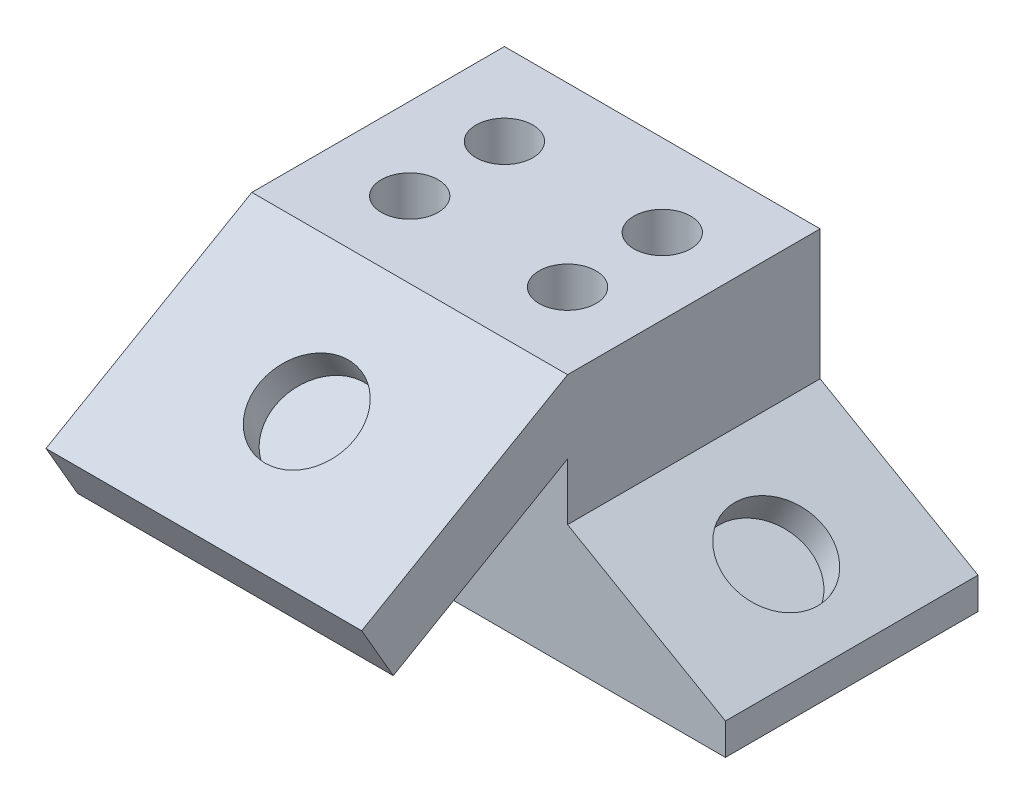
ISO-10303-21;
HEADER;
FILE_DESCRIPTION(('STEP AP214'),'2;1');
FILE_NAME('part.step','',(''),(''),'','','');
FILE_SCHEMA(('AUTOMOTIVE_DESIGN { 1 0 10303 214 1 1 1 1 }'));
ENDSEC;
DATA;
#1=APPLICATION_CONTEXT('core data for automotive mechanical design processes');
#2=APPLICATION_PROTOCOL_DEFINITION('international standard','automotive_design',2000,#1);
#3=PRODUCT_CONTEXT('',#1,'mechanical');
#4=PRODUCT('Part','Part','',(#3));
#5=PRODUCT_RELATED_PRODUCT_CATEGORY('part','',(#4));
#6=PRODUCT_DEFINITION_FORMATION('','',#4);
#7=PRODUCT_DEFINITION_CONTEXT('part definition',#1,'design');
#8=PRODUCT_DEFINITION('design','',#6,#7);
#9=PRODUCT_DEFINITION_SHAPE('','',#8);
#10=(LENGTH_UNIT() NAMED_UNIT(*) SI_UNIT(.MILLI.,.METRE.));
#11=(NAMED_UNIT(*) PLANE_ANGLE_UNIT() SI_UNIT($,.RADIAN.));
#12=(NAMED_UNIT(*) SI_UNIT($,.STERADIAN.) SOLID_ANGLE_UNIT());
#13=UNCERTAINTY_MEASURE_WITH_UNIT(LENGTH_MEASURE(1.E-05),#10,'distance_accuracy_value','');
#14=(GEOMETRIC_REPRESENTATION_CONTEXT(3) GLOBAL_UNCERTAINTY_ASSIGNED_CONTEXT((#13)) GLOBAL_UNIT_ASSIGNED_CONTEXT((#10,
#11,#12)) REPRESENTATION_CONTEXT('',''));
#15=CARTESIAN_POINT('',(0.,0.,0.));
#16=DIRECTION('',(0.,0.,1.));
#17=DIRECTION('',(1.,0.,0.));
#18=AXIS2_PLACEMENT_3D('',#15,#16,#17);
#19=CARTESIAN_POINT('',(0.,50.8,0.));
#20=DIRECTION('',(0.,1.,0.));
#21=DIRECTION('',(0.,0.,1.));
#22=AXIS2_PLACEMENT_3D('',#19,#20,#21);
#23=PLANE('',#22);
#24=CARTESIAN_POINT('',(16.51,50.8,10.16));
#25=DIRECTION('',(0.,-1.,0.));
#26=DIRECTION('',(0.,0.,-1.));
#27=AXIS2_PLACEMENT_3D('',#24,#25,#26);
#28=CIRCLE('',#27,5.715);
#29=CARTESIAN_POINT('',(16.51,50.8,4.44499999999999));
#30=VERTEX_POINT('',#29);
#31=EDGE_CURVE('E452',#30,#30,#28,.T.);
#32=ORIENTED_EDGE('',*,*,#31,.T.);
#33=EDGE_LOOP('',(#32));
#34=FACE_BOUND('',#33,.T.);
#35=CARTESIAN_POINT('',(-15.24,50.8,-8.89000000000001));
#36=DIRECTION('',(0.,-1.,0.));
#37=DIRECTION('',(0.,0.,-1.));
#38=AXIS2_PLACEMENT_3D('',#35,#36,#37);
#39=CIRCLE('',#38,5.715);
#40=CARTESIAN_POINT('',(-15.24,50.8,-14.605));
#41=VERTEX_POINT('',#40);
#42=EDGE_CURVE('E437',#41,#41,#39,.T.);
#43=ORIENTED_EDGE('',*,*,#42,.T.);
#44=EDGE_LOOP('',(#43));
#45=FACE_BOUND('',#44,.T.);
#46=DIRECTION('',(0.,0.,1.));
#47=VECTOR('',#46,1.);
#48=CARTESIAN_POINT('',(-31.75,50.8,25.4));
#49=LINE('',#48,#47);
#50=CARTESIAN_POINT('',(-31.75,50.8,-25.4));
#51=VERTEX_POINT('',#50);
#52=CARTESIAN_POINT('',(-31.75,50.8,25.4));
#53=VERTEX_POINT('',#52);
#54=EDGE_CURVE('E172',#51,#53,#49,.T.);
#55=ORIENTED_EDGE('',*,*,#54,.T.);
#56=DIRECTION('',(1.,0.,0.));
#57=VECTOR('',#56,1.);
#58=CARTESIAN_POINT('',(31.75,50.8,25.4));
#59=LINE('',#58,#57);
#60=CARTESIAN_POINT('',(31.75,50.8,25.4));
#61=VERTEX_POINT('',#60);
#62=EDGE_CURVE('E132',#53,#61,#59,.T.);
#63=ORIENTED_EDGE('',*,*,#62,.T.);
#64=DIRECTION('',(0.,0.,-1.));
#65=VECTOR('',#64,1.);
#66=CARTESIAN_POINT('',(31.75,50.8,25.4));
#67=LINE('',#66,#65);
#68=CARTESIAN_POINT('',(31.75,50.8,-25.4));
#69=VERTEX_POINT('',#68);
#70=EDGE_CURVE('E176',#61,#69,#67,.T.);
#71=ORIENTED_EDGE('',*,*,#70,.T.);
#72=DIRECTION('',(-1.,0.,0.));
#73=VECTOR('',#72,1.);
#74=CARTESIAN_POINT('',(31.75,50.8,-25.4));
#75=LINE('',#74,#73);
#76=EDGE_CURVE('E178',#69,#51,#75,.T.);
#77=ORIENTED_EDGE('',*,*,#76,.T.);
#78=EDGE_LOOP('',(#55,#63,#71,#77));
#79=FACE_BOUND('',#78,.T.);
#80=CARTESIAN_POINT('',(16.51,50.8,-8.89000000000001));
#81=DIRECTION('',(0.,1.,0.));
#82=DIRECTION('',(0.,0.,1.));
#83=AXIS2_PLACEMENT_3D('',#80,#81,#82);
#84=CIRCLE('',#83,5.715);
#85=CARTESIAN_POINT('',(16.51,50.8,-3.17500000000001));
#86=VERTEX_POINT('',#85);
#87=EDGE_CURVE('E439',#86,#86,#84,.T.);
#88=ORIENTED_EDGE('',*,*,#87,.F.);
#89=EDGE_LOOP('',(#88));
#90=FACE_BOUND('',#89,.T.);
#91=CARTESIAN_POINT('',(-15.24,50.8,10.16));
#92=DIRECTION('',(0.,1.,0.));
#93=DIRECTION('',(0.,0.,1.));
#94=AXIS2_PLACEMENT_3D('',#91,#92,#93);
#95=CIRCLE('',#94,5.715);
#96=CARTESIAN_POINT('',(-15.24,50.8,15.875));
#97=VERTEX_POINT('',#96);
#98=EDGE_CURVE('E427',#97,#97,#95,.T.);
#99=ORIENTED_EDGE('',*,*,#98,.F.);
#100=EDGE_LOOP('',(#99));
#101=FACE_BOUND('',#100,.T.);
#102=ADVANCED_FACE('F38',(#34,#45,#79,#90,#101),#23,.T.);
#103=CARTESIAN_POINT('',(31.75,50.8,25.4));
#104=DIRECTION('',(0.,0.,-1.));
#105=DIRECTION('',(-1.,0.,0.));
#106=AXIS2_PLACEMENT_3D('',#103,#104,#105);
#107=PLANE('',#106);
#108=DIRECTION('',(1.,0.,0.));
#109=VECTOR('',#108,1.);
#110=CARTESIAN_POINT('',(-31.75,36.1353031625836,25.4));
#111=LINE('',#110,#109);
#112=CARTESIAN_POINT('',(-31.75,36.1353031625836,25.4));
#113=VERTEX_POINT('',#112);
#114=CARTESIAN_POINT('',(31.75,36.1353031625836,25.4));
#115=VERTEX_POINT('',#114);
#116=EDGE_CURVE('E52',#113,#115,#111,.T.);
#117=ORIENTED_EDGE('',*,*,#116,.F.);
#118=DIRECTION('',(0.,-1.,0.));
#119=VECTOR('',#118,1.);
#120=CARTESIAN_POINT('',(-31.75,50.8,25.4));
#121=LINE('',#120,#119);
#122=CARTESIAN_POINT('',(-31.75,0.,25.4));
#123=VERTEX_POINT('',#122);
#124=EDGE_CURVE('E11',#113,#123,#121,.T.);
#125=ORIENTED_EDGE('',*,*,#124,.T.);
#126=DIRECTION('',(1.,0.,0.));
#127=VECTOR('',#126,1.);
#128=CARTESIAN_POINT('',(31.75,0.,25.4));
#129=LINE('',#128,#127);
#130=CARTESIAN_POINT('',(63.5,0.,25.4));
#131=VERTEX_POINT('',#130);
#132=EDGE_CURVE('E182',#123,#131,#129,.T.);
#133=ORIENTED_EDGE('',*,*,#132,.T.);
#134=DIRECTION('',(0.,-1.,0.));
#135=VECTOR('',#134,1.);
#136=CARTESIAN_POINT('',(63.5,0.,25.4));
#137=LINE('',#136,#135);
#138=CARTESIAN_POINT('',(63.5,6.35,25.4));
#139=VERTEX_POINT('',#138);
#140=EDGE_CURVE('E152',#139,#131,#137,.T.);
#141=ORIENTED_EDGE('',*,*,#140,.F.);
#142=DIRECTION('',(0.86602540378444,-0.499999999999998,0.));
#143=VECTOR('',#142,1.);
#144=CARTESIAN_POINT('',(18.6246306570154,32.2588065701559,25.4));
#145=LINE('',#144,#143);
#146=CARTESIAN_POINT('',(31.75,24.6808710467705,25.4));
#147=VERTEX_POINT('',#146);
#148=EDGE_CURVE('E159',#147,#139,#145,.T.);
#149=ORIENTED_EDGE('',*,*,#148,.F.);
#150=DIRECTION('',(0.,-1.,0.));
#151=VECTOR('',#150,1.);
#152=CARTESIAN_POINT('',(31.75,50.8,25.4));
#153=LINE('',#152,#151);
#154=EDGE_CURVE('E46',#115,#147,#153,.T.);
#155=ORIENTED_EDGE('',*,*,#154,.F.);
#156=EDGE_LOOP('',(#117,#125,#133,#141,#149,#155));
#157=FACE_BOUND('',#156,.T.);
#158=ADVANCED_FACE('F196',(#157),#107,.F.);
#159=CARTESIAN_POINT('',(31.75,50.8,25.4));
#160=DIRECTION('',(-1.,0.,0.));
#161=DIRECTION('',(0.,0.,1.));
#162=AXIS2_PLACEMENT_3D('',#159,#160,#161);
#163=PLANE('',#162);
#164=DIRECTION('',(0.,0.,1.));
#165=VECTOR('',#164,1.);
#166=CARTESIAN_POINT('',(31.75,24.6808710467705,-25.4));
#167=LINE('',#166,#165);
#168=CARTESIAN_POINT('',(31.75,24.6808710467705,-25.4));
#169=VERTEX_POINT('',#168);
#170=EDGE_CURVE('E60',#169,#147,#167,.T.);
#171=ORIENTED_EDGE('',*,*,#170,.F.);
#172=DIRECTION('',(0.,-1.,0.));
#173=VECTOR('',#172,1.);
#174=CARTESIAN_POINT('',(31.75,50.8,-25.4));
#175=LINE('',#174,#173);
#176=EDGE_CURVE('E187',#69,#169,#175,.T.);
#177=ORIENTED_EDGE('',*,*,#176,.F.);
#178=ORIENTED_EDGE('',*,*,#70,.F.);
#179=DIRECTION('',(0.,-0.499999999999995,0.866025403784442));
#180=VECTOR('',#179,1.);
#181=CARTESIAN_POINT('',(31.75,50.8,25.4));
#182=LINE('',#181,#180);
#183=CARTESIAN_POINT('',(31.75,26.8965441550114,66.802));
#184=VERTEX_POINT('',#183);
#185=EDGE_CURVE('E142',#61,#184,#182,.T.);
#186=ORIENTED_EDGE('',*,*,#185,.T.);
#187=DIRECTION('',(0.,-0.866025403784441,-0.499999999999995));
#188=VECTOR('',#187,1.);
#189=CARTESIAN_POINT('',(31.75,26.8965441550114,66.802));
#190=LINE('',#189,#188);
#191=CARTESIAN_POINT('',(31.75,15.898021526949,60.452));
#192=VERTEX_POINT('',#191);
#193=EDGE_CURVE('E115',#184,#192,#190,.T.);
#194=ORIENTED_EDGE('',*,*,#193,.T.);
#195=DIRECTION('',(0.,0.499999999999995,-0.866025403784441));
#196=VECTOR('',#195,1.);
#197=CARTESIAN_POINT('',(31.75,15.898021526949,60.452));
#198=LINE('',#197,#196);
#199=EDGE_CURVE('E133',#192,#115,#198,.T.);
#200=ORIENTED_EDGE('',*,*,#199,.T.);
#201=ORIENTED_EDGE('',*,*,#154,.T.);
#202=EDGE_LOOP('',(#171,#177,#178,#186,#194,#200,#201));
#203=FACE_BOUND('',#202,.T.);
#204=ADVANCED_FACE('F188',(#203),#163,.F.);
#205=CARTESIAN_POINT('',(-31.75,50.8,25.4));
#206=DIRECTION('',(1.,0.,0.));
#207=DIRECTION('',(0.,0.,-1.));
#208=AXIS2_PLACEMENT_3D('',#205,#206,#207);
#209=PLANE('',#208);
#210=DIRECTION('',(0.,0.,1.));
#211=VECTOR('',#210,1.);
#212=CARTESIAN_POINT('',(-31.75,0.,25.4));
#213=LINE('',#212,#211);
#214=CARTESIAN_POINT('',(-31.75,0.,-25.4));
#215=VERTEX_POINT('',#214);
#216=EDGE_CURVE('E166',#215,#123,#213,.T.);
#217=ORIENTED_EDGE('',*,*,#216,.T.);
#218=ORIENTED_EDGE('',*,*,#124,.F.);
#219=DIRECTION('',(0.,0.499999999999995,-0.866025403784441));
#220=VECTOR('',#219,1.);
#221=CARTESIAN_POINT('',(-31.75,15.898021526949,60.452));
#222=LINE('',#221,#220);
#223=CARTESIAN_POINT('',(-31.75,15.898021526949,60.452));
#224=VERTEX_POINT('',#223);
#225=EDGE_CURVE('E121',#224,#113,#222,.T.);
#226=ORIENTED_EDGE('',*,*,#225,.F.);
#227=DIRECTION('',(0.,-0.866025403784441,-0.499999999999995));
#228=VECTOR('',#227,1.);
#229=CARTESIAN_POINT('',(-31.75,26.8965441550114,66.802));
#230=LINE('',#229,#228);
#231=CARTESIAN_POINT('',(-31.75,26.8965441550114,66.802));
#232=VERTEX_POINT('',#231);
#233=EDGE_CURVE('E112',#232,#224,#230,.T.);
#234=ORIENTED_EDGE('',*,*,#233,.F.);
#235=DIRECTION('',(0.,-0.499999999999995,0.866025403784442));
#236=VECTOR('',#235,1.);
#237=CARTESIAN_POINT('',(-31.75,50.8,25.4));
#238=LINE('',#237,#236);
#239=EDGE_CURVE('E127',#53,#232,#238,.T.);
#240=ORIENTED_EDGE('',*,*,#239,.F.);
#241=ORIENTED_EDGE('',*,*,#54,.F.);
#242=DIRECTION('',(0.,-1.,0.));
#243=VECTOR('',#242,1.);
#244=CARTESIAN_POINT('',(-31.75,50.8,-25.4));
#245=LINE('',#244,#243);
#246=EDGE_CURVE('E180',#51,#215,#245,.T.);
#247=ORIENTED_EDGE('',*,*,#246,.T.);
#248=EDGE_LOOP('',(#217,#218,#226,#234,#240,#241,#247));
#249=FACE_BOUND('',#248,.T.);
#250=ADVANCED_FACE('F40',(#249),#209,.F.);
#251=CARTESIAN_POINT('',(31.75,50.8,-25.4));
#252=DIRECTION('',(0.,0.,1.));
#253=DIRECTION('',(1.,0.,0.));
#254=AXIS2_PLACEMENT_3D('',#251,#252,#253);
#255=PLANE('',#254);
#256=DIRECTION('',(-1.,0.,0.));
#257=VECTOR('',#256,1.);
#258=CARTESIAN_POINT('',(31.75,0.,-25.4));
#259=LINE('',#258,#257);
#260=CARTESIAN_POINT('',(63.5,0.,-25.4));
#261=VERTEX_POINT('',#260);
#262=EDGE_CURVE('E174',#261,#215,#259,.T.);
#263=ORIENTED_EDGE('',*,*,#262,.T.);
#264=ORIENTED_EDGE('',*,*,#246,.F.);
#265=ORIENTED_EDGE('',*,*,#76,.F.);
#266=ORIENTED_EDGE('',*,*,#176,.T.);
#267=DIRECTION('',(0.86602540378444,-0.499999999999998,0.));
#268=VECTOR('',#267,1.);
#269=CARTESIAN_POINT('',(18.6246306570154,32.2588065701559,-25.4));
#270=LINE('',#269,#268);
#271=CARTESIAN_POINT('',(63.5,6.35,-25.4));
#272=VERTEX_POINT('',#271);
#273=EDGE_CURVE('E158',#169,#272,#270,.T.);
#274=ORIENTED_EDGE('',*,*,#273,.T.);
#275=DIRECTION('',(0.,-1.,0.));
#276=VECTOR('',#275,1.);
#277=CARTESIAN_POINT('',(63.5,0.,-25.4));
#278=LINE('',#277,#276);
#279=EDGE_CURVE('E155',#272,#261,#278,.T.);
#280=ORIENTED_EDGE('',*,*,#279,.T.);
#281=EDGE_LOOP('',(#263,#264,#265,#266,#274,#280));
#282=FACE_BOUND('',#281,.T.);
#283=ADVANCED_FACE('F207',(#282),#255,.F.);
#284=CARTESIAN_POINT('',(0.,0.,0.));
#285=DIRECTION('',(0.,1.,0.));
#286=DIRECTION('',(0.,0.,1.));
#287=AXIS2_PLACEMENT_3D('',#284,#285,#286);
#288=PLANE('',#287);
#289=ORIENTED_EDGE('',*,*,#216,.F.);
#290=ORIENTED_EDGE('',*,*,#262,.F.);
#291=DIRECTION('',(0.,0.,1.));
#292=VECTOR('',#291,1.);
#293=CARTESIAN_POINT('',(63.5,0.,-25.4));
#294=LINE('',#293,#292);
#295=EDGE_CURVE('E161',#261,#131,#294,.T.);
#296=ORIENTED_EDGE('',*,*,#295,.T.);
#297=ORIENTED_EDGE('',*,*,#132,.F.);
#298=EDGE_LOOP('',(#289,#290,#296,#297));
#299=FACE_BOUND('',#298,.T.);
#300=ADVANCED_FACE('F204',(#299),#288,.F.);
#301=CARTESIAN_POINT('',(18.6246306570154,32.2588065701559,-25.4));
#302=DIRECTION('',(-0.499999999999998,-0.86602540378444,0.));
#303=DIRECTION('',(0.86602540378444,-0.499999999999998,0.));
#304=AXIS2_PLACEMENT_3D('',#301,#302,#303);
#305=PLANE('',#304);
#306=CARTESIAN_POINT('',(48.3201594106394,15.1140850505229,0.));
#307=DIRECTION('',(0.499999999999998,0.86602540378444,0.));
#308=DIRECTION('',(-0.86602540378444,0.499999999999998,0.));
#309=AXIS2_PLACEMENT_3D('',#306,#307,#308);
#310=CIRCLE('',#309,9.652);
#311=CARTESIAN_POINT('',(39.961282213312,19.9400850505228,0.));
#312=VERTEX_POINT('',#311);
#313=EDGE_CURVE('E147',#312,#312,#310,.T.);
#314=ORIENTED_EDGE('',*,*,#313,.F.);
#315=EDGE_LOOP('',(#314));
#316=FACE_BOUND('',#315,.T.);
#317=ORIENTED_EDGE('',*,*,#148,.T.);
#318=DIRECTION('',(0.,0.,1.));
#319=VECTOR('',#318,1.);
#320=CARTESIAN_POINT('',(63.5,6.35,-25.4));
#321=LINE('',#320,#319);
#322=EDGE_CURVE('E167',#272,#139,#321,.T.);
#323=ORIENTED_EDGE('',*,*,#322,.F.);
#324=ORIENTED_EDGE('',*,*,#273,.F.);
#325=ORIENTED_EDGE('',*,*,#170,.T.);
#326=EDGE_LOOP('',(#317,#323,#324,#325));
#327=FACE_BOUND('',#326,.T.);
#328=ADVANCED_FACE('F193',(#316,#327),#305,.F.);
#329=CARTESIAN_POINT('',(63.5,0.,-25.4));
#330=DIRECTION('',(-1.,0.,0.));
#331=DIRECTION('',(0.,0.,1.));
#332=AXIS2_PLACEMENT_3D('',#329,#330,#331);
#333=PLANE('',#332);
#334=ORIENTED_EDGE('',*,*,#140,.T.);
#335=ORIENTED_EDGE('',*,*,#295,.F.);
#336=ORIENTED_EDGE('',*,*,#279,.F.);
#337=ORIENTED_EDGE('',*,*,#322,.T.);
#338=EDGE_LOOP('',(#334,#335,#336,#337));
#339=FACE_BOUND('',#338,.T.);
#340=ADVANCED_FACE('F200',(#339),#333,.F.);
#341=CARTESIAN_POINT('',(45.1451594106395,9.61482373649168,0.));
#342=DIRECTION('',(0.499999999999998,0.86602540378444,0.));
#343=DIRECTION('',(-0.86602540378444,0.499999999999998,0.));
#344=AXIS2_PLACEMENT_3D('',#341,#342,#343);
#345=CYLINDRICAL_SURFACE('',#344,9.652);
#346=CARTESIAN_POINT('',(45.1451594106395,9.61482373649168,0.));
#347=DIRECTION('',(0.499999999999998,0.86602540378444,0.));
#348=DIRECTION('',(-0.86602540378444,0.499999999999998,0.));
#349=AXIS2_PLACEMENT_3D('',#346,#347,#348);
#350=CIRCLE('',#349,9.652);
#351=CARTESIAN_POINT('',(36.786282213312,14.4408237364917,0.));
#352=VERTEX_POINT('',#351);
#353=EDGE_CURVE('E149',#352,#352,#350,.T.);
#354=ORIENTED_EDGE('',*,*,#353,.F.);
#355=EDGE_LOOP('',(#354));
#356=FACE_BOUND('',#355,.T.);
#357=ORIENTED_EDGE('',*,*,#313,.T.);
#358=EDGE_LOOP('',(#357));
#359=FACE_BOUND('',#358,.T.);
#360=ADVANCED_FACE('F222',(#356,#359),#345,.F.);
#361=CARTESIAN_POINT('',(45.1451594106395,9.61482373649168,0.));
#362=DIRECTION('',(0.499999999999998,0.86602540378444,0.));
#363=DIRECTION('',(-0.86602540378444,0.499999999999998,0.));
#364=AXIS2_PLACEMENT_3D('',#361,#362,#363);
#365=PLANE('',#364);
#366=ORIENTED_EDGE('',*,*,#353,.T.);
#367=EDGE_LOOP('',(#366));
#368=FACE_BOUND('',#367,.T.);
#369=ADVANCED_FACE('F215',(#368),#365,.T.);
#370=CARTESIAN_POINT('',(-31.75,15.898021526949,60.452));
#371=DIRECTION('',(0.,-0.866025403784441,-0.499999999999995));
#372=DIRECTION('',(0.,0.499999999999995,-0.866025403784441));
#373=AXIS2_PLACEMENT_3D('',#370,#371,#372);
#374=PLANE('',#373);
#375=ORIENTED_EDGE('',*,*,#199,.F.);
#376=DIRECTION('',(1.,0.,0.));
#377=VECTOR('',#376,1.);
#378=CARTESIAN_POINT('',(-31.75,15.898021526949,60.452));
#379=LINE('',#378,#377);
#380=EDGE_CURVE('E120',#224,#192,#379,.T.);
#381=ORIENTED_EDGE('',*,*,#380,.F.);
#382=ORIENTED_EDGE('',*,*,#225,.T.);
#383=ORIENTED_EDGE('',*,*,#116,.T.);
#384=EDGE_LOOP('',(#375,#381,#382,#383));
#385=FACE_BOUND('',#384,.T.);
#386=ADVANCED_FACE('F213',(#385),#374,.T.);
#387=CARTESIAN_POINT('',(-31.75,26.8965441550114,66.802));
#388=DIRECTION('',(0.,-0.499999999999995,0.866025403784441));
#389=DIRECTION('',(0.,-0.866025403784441,-0.499999999999995));
#390=AXIS2_PLACEMENT_3D('',#387,#388,#389);
#391=PLANE('',#390);
#392=ORIENTED_EDGE('',*,*,#193,.F.);
#393=DIRECTION('',(1.,0.,0.));
#394=VECTOR('',#393,1.);
#395=CARTESIAN_POINT('',(-31.75,26.8965441550114,66.802));
#396=LINE('',#395,#394);
#397=EDGE_CURVE('E109',#232,#184,#396,.T.);
#398=ORIENTED_EDGE('',*,*,#397,.F.);
#399=ORIENTED_EDGE('',*,*,#233,.T.);
#400=ORIENTED_EDGE('',*,*,#380,.T.);
#401=EDGE_LOOP('',(#392,#398,#399,#400));
#402=FACE_BOUND('',#401,.T.);
#403=ADVANCED_FACE('F111',(#402),#391,.T.);
#404=CARTESIAN_POINT('',(-31.75,50.8,25.4));
#405=DIRECTION('',(0.,0.866025403784442,0.499999999999995));
#406=DIRECTION('',(0.,-0.499999999999995,0.866025403784442));
#407=AXIS2_PLACEMENT_3D('',#404,#405,#406);
#408=PLANE('',#407);
#409=CARTESIAN_POINT('',(0.,38.8482720775057,46.101));
#410=DIRECTION('',(0.,0.866025403784441,0.499999999999995));
#411=DIRECTION('',(0.,-0.499999999999995,0.866025403784441));
#412=AXIS2_PLACEMENT_3D('',#409,#410,#411);
#413=CIRCLE('',#412,9.652);
#414=CARTESIAN_POINT('',(0.,34.0222720775058,54.4598771973274));
#415=VERTEX_POINT('',#414);
#416=EDGE_CURVE('E138',#415,#415,#413,.T.);
#417=ORIENTED_EDGE('',*,*,#416,.F.);
#418=EDGE_LOOP('',(#417));
#419=FACE_BOUND('',#418,.T.);
#420=ORIENTED_EDGE('',*,*,#185,.F.);
#421=ORIENTED_EDGE('',*,*,#62,.F.);
#422=ORIENTED_EDGE('',*,*,#239,.T.);
#423=ORIENTED_EDGE('',*,*,#397,.T.);
#424=EDGE_LOOP('',(#420,#421,#422,#423));
#425=FACE_BOUND('',#424,.T.);
#426=ADVANCED_FACE('F131',(#419,#425),#408,.T.);
#427=CARTESIAN_POINT('',(0.,33.3490107634745,42.926));
#428=DIRECTION('',(0.,0.866025403784441,0.499999999999995));
#429=DIRECTION('',(0.,-0.499999999999995,0.866025403784441));
#430=AXIS2_PLACEMENT_3D('',#427,#428,#429);
#431=CYLINDRICAL_SURFACE('',#430,9.652);
#432=CARTESIAN_POINT('',(0.,33.3490107634745,42.926));
#433=DIRECTION('',(0.,0.866025403784441,0.499999999999995));
#434=DIRECTION('',(0.,-0.499999999999995,0.866025403784441));
#435=AXIS2_PLACEMENT_3D('',#432,#433,#434);
#436=CIRCLE('',#435,9.652);
#437=CARTESIAN_POINT('',(0.,28.5230107634746,51.2848771973274));
#438=VERTEX_POINT('',#437);
#439=EDGE_CURVE('E144',#438,#438,#436,.T.);
#440=ORIENTED_EDGE('',*,*,#439,.F.);
#441=EDGE_LOOP('',(#440));
#442=FACE_BOUND('',#441,.T.);
#443=ORIENTED_EDGE('',*,*,#416,.T.);
#444=EDGE_LOOP('',(#443));
#445=FACE_BOUND('',#444,.T.);
#446=ADVANCED_FACE('F317',(#442,#445),#431,.F.);
#447=CARTESIAN_POINT('',(0.,33.3490107634745,42.926));
#448=DIRECTION('',(0.,0.866025403784441,0.499999999999995));
#449=DIRECTION('',(0.,-0.499999999999995,0.866025403784441));
#450=AXIS2_PLACEMENT_3D('',#447,#448,#449);
#451=PLANE('',#450);
#452=ORIENTED_EDGE('',*,*,#439,.T.);
#453=EDGE_LOOP('',(#452));
#454=FACE_BOUND('',#453,.T.);
#455=ADVANCED_FACE('F326',(#454),#451,.T.);
#456=CARTESIAN_POINT('',(-15.24,38.1,-8.89000000000001));
#457=DIRECTION('',(0.,1.,0.));
#458=DIRECTION('',(0.,0.,1.));
#459=AXIS2_PLACEMENT_3D('',#456,#457,#458);
#460=CYLINDRICAL_SURFACE('',#459,5.715);
#461=CARTESIAN_POINT('',(-15.24,38.1,-8.89000000000001));
#462=DIRECTION('',(0.,-1.,0.));
#463=DIRECTION('',(0.,0.,-1.));
#464=AXIS2_PLACEMENT_3D('',#461,#462,#463);
#465=CIRCLE('',#464,5.715);
#466=CARTESIAN_POINT('',(-15.24,38.1,-14.605));
#467=VERTEX_POINT('',#466);
#468=EDGE_CURVE('E434',#467,#467,#465,.T.);
#469=ORIENTED_EDGE('',*,*,#468,.T.);
#470=EDGE_LOOP('',(#469));
#471=FACE_BOUND('',#470,.T.);
#472=ORIENTED_EDGE('',*,*,#42,.F.);
#473=EDGE_LOOP('',(#472));
#474=FACE_BOUND('',#473,.T.);
#475=ADVANCED_FACE('F334',(#471,#474),#460,.F.);
#476=CARTESIAN_POINT('',(-15.24,38.1,-8.89000000000001));
#477=DIRECTION('',(0.,-1.,0.));
#478=DIRECTION('',(0.,0.,-1.));
#479=AXIS2_PLACEMENT_3D('',#476,#477,#478);
#480=PLANE('',#479);
#481=ORIENTED_EDGE('',*,*,#468,.F.);
#482=EDGE_LOOP('',(#481));
#483=FACE_BOUND('',#482,.T.);
#484=ADVANCED_FACE('F347',(#483),#480,.F.);
#485=CARTESIAN_POINT('',(16.51,38.1,-8.89000000000001));
#486=DIRECTION('',(0.,1.,0.));
#487=DIRECTION('',(0.,0.,1.));
#488=AXIS2_PLACEMENT_3D('',#485,#486,#487);
#489=CYLINDRICAL_SURFACE('',#488,5.715);
#490=CARTESIAN_POINT('',(16.51,38.1,-8.89000000000001));
#491=DIRECTION('',(0.,1.,0.));
#492=DIRECTION('',(0.,0.,1.));
#493=AXIS2_PLACEMENT_3D('',#490,#491,#492);
#494=CIRCLE('',#493,5.715);
#495=CARTESIAN_POINT('',(16.51,38.1,-3.17500000000001));
#496=VERTEX_POINT('',#495);
#497=EDGE_CURVE('E447',#496,#496,#494,.T.);
#498=ORIENTED_EDGE('',*,*,#497,.F.);
#499=EDGE_LOOP('',(#498));
#500=FACE_BOUND('',#499,.T.);
#501=ORIENTED_EDGE('',*,*,#87,.T.);
#502=EDGE_LOOP('',(#501));
#503=FACE_BOUND('',#502,.T.);
#504=ADVANCED_FACE('F356',(#500,#503),#489,.F.);
#505=CARTESIAN_POINT('',(16.51,38.1,-8.89000000000001));
#506=DIRECTION('',(0.,1.,0.));
#507=DIRECTION('',(0.,0.,1.));
#508=AXIS2_PLACEMENT_3D('',#505,#506,#507);
#509=PLANE('',#508);
#510=ORIENTED_EDGE('',*,*,#497,.T.);
#511=EDGE_LOOP('',(#510));
#512=FACE_BOUND('',#511,.T.);
#513=ADVANCED_FACE('F365',(#512),#509,.T.);
#514=CARTESIAN_POINT('',(16.51,38.1,10.16));
#515=DIRECTION('',(0.,1.,0.));
#516=DIRECTION('',(0.,0.,1.));
#517=AXIS2_PLACEMENT_3D('',#514,#515,#516);
#518=CYLINDRICAL_SURFACE('',#517,5.715);
#519=CARTESIAN_POINT('',(16.51,38.1,10.16));
#520=DIRECTION('',(0.,-1.,0.));
#521=DIRECTION('',(0.,0.,-1.));
#522=AXIS2_PLACEMENT_3D('',#519,#520,#521);
#523=CIRCLE('',#522,5.715);
#524=CARTESIAN_POINT('',(16.51,38.1,4.44499999999999));
#525=VERTEX_POINT('',#524);
#526=EDGE_CURVE('E430',#525,#525,#523,.T.);
#527=ORIENTED_EDGE('',*,*,#526,.T.);
#528=EDGE_LOOP('',(#527));
#529=FACE_BOUND('',#528,.T.);
#530=ORIENTED_EDGE('',*,*,#31,.F.);
#531=EDGE_LOOP('',(#530));
#532=FACE_BOUND('',#531,.T.);
#533=ADVANCED_FACE('F374',(#529,#532),#518,.F.);
#534=CARTESIAN_POINT('',(16.51,38.1,10.16));
#535=DIRECTION('',(0.,-1.,0.));
#536=DIRECTION('',(0.,0.,-1.));
#537=AXIS2_PLACEMENT_3D('',#534,#535,#536);
#538=PLANE('',#537);
#539=ORIENTED_EDGE('',*,*,#526,.F.);
#540=EDGE_LOOP('',(#539));
#541=FACE_BOUND('',#540,.T.);
#542=ADVANCED_FACE('F383',(#541),#538,.F.);
#543=CARTESIAN_POINT('',(-15.24,38.1,10.16));
#544=DIRECTION('',(0.,1.,0.));
#545=DIRECTION('',(0.,0.,1.));
#546=AXIS2_PLACEMENT_3D('',#543,#544,#545);
#547=CYLINDRICAL_SURFACE('',#546,5.715);
#548=CARTESIAN_POINT('',(-15.24,38.1,10.16));
#549=DIRECTION('',(0.,1.,0.));
#550=DIRECTION('',(0.,0.,1.));
#551=AXIS2_PLACEMENT_3D('',#548,#549,#550);
#552=CIRCLE('',#551,5.715);
#553=CARTESIAN_POINT('',(-15.24,38.1,15.875));
#554=VERTEX_POINT('',#553);
#555=EDGE_CURVE('E426',#554,#554,#552,.T.);
#556=ORIENTED_EDGE('',*,*,#555,.F.);
#557=EDGE_LOOP('',(#556));
#558=FACE_BOUND('',#557,.T.);
#559=ORIENTED_EDGE('',*,*,#98,.T.);
#560=EDGE_LOOP('',(#559));
#561=FACE_BOUND('',#560,.T.);
#562=ADVANCED_FACE('F392',(#558,#561),#547,.F.);
#563=CARTESIAN_POINT('',(-15.24,38.1,10.16));
#564=DIRECTION('',(0.,1.,0.));
#565=DIRECTION('',(0.,0.,1.));
#566=AXIS2_PLACEMENT_3D('',#563,#564,#565);
#567=PLANE('',#566);
#568=ORIENTED_EDGE('',*,*,#555,.T.);
#569=EDGE_LOOP('',(#568));
#570=FACE_BOUND('',#569,.T.);
#571=ADVANCED_FACE('F401',(#570),#567,.T.);
#572=CLOSED_SHELL('',(#102,#158,#204,#250,#283,#300,#328,#340,#360,#369,#386,#403,#426,#446,
#455,#475,#484,#504,#513,#533,#542,#562,#571));
#573=MANIFOLD_SOLID_BREP('B2',#572);
#574=ADVANCED_BREP_SHAPE_REPRESENTATION('',(#18,#573),#14);
#575=SHAPE_DEFINITION_REPRESENTATION(#9,#574);
ENDSEC;
END-ISO-10303-21;
